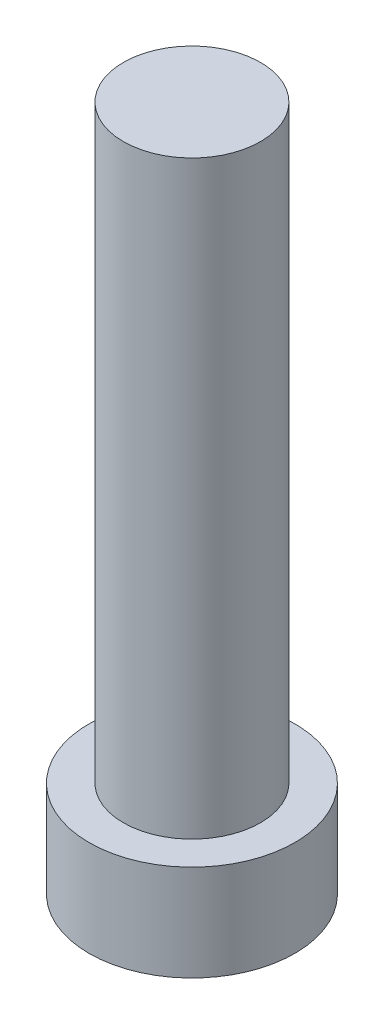
ISO-10303-21;
HEADER;
FILE_DESCRIPTION(('STEP AP214'),'2;1');
FILE_NAME('part.step','',(''),(''),'','','');
FILE_SCHEMA(('AUTOMOTIVE_DESIGN { 1 0 10303 214 1 1 1 1 }'));
ENDSEC;
DATA;
#1=APPLICATION_CONTEXT('core data for automotive mechanical design processes');
#2=APPLICATION_PROTOCOL_DEFINITION('international standard','automotive_design',2000,#1);
#3=PRODUCT_CONTEXT('',#1,'mechanical');
#4=PRODUCT('Part','Part','',(#3));
#5=PRODUCT_RELATED_PRODUCT_CATEGORY('part','',(#4));
#6=PRODUCT_DEFINITION_FORMATION('','',#4);
#7=PRODUCT_DEFINITION_CONTEXT('part definition',#1,'design');
#8=PRODUCT_DEFINITION('design','',#6,#7);
#9=PRODUCT_DEFINITION_SHAPE('','',#8);
#10=(LENGTH_UNIT() NAMED_UNIT(*) SI_UNIT(.MILLI.,.METRE.));
#11=(NAMED_UNIT(*) PLANE_ANGLE_UNIT() SI_UNIT($,.RADIAN.));
#12=(NAMED_UNIT(*) SI_UNIT($,.STERADIAN.) SOLID_ANGLE_UNIT());
#13=UNCERTAINTY_MEASURE_WITH_UNIT(LENGTH_MEASURE(1.E-05),#10,'distance_accuracy_value','');
#14=(GEOMETRIC_REPRESENTATION_CONTEXT(3) GLOBAL_UNCERTAINTY_ASSIGNED_CONTEXT((#13)) GLOBAL_UNIT_ASSIGNED_CONTEXT((#10,
#11,#12)) REPRESENTATION_CONTEXT('',''));
#15=CARTESIAN_POINT('',(0.,0.,0.));
#16=DIRECTION('',(0.,0.,1.));
#17=DIRECTION('',(1.,0.,0.));
#18=AXIS2_PLACEMENT_3D('',#15,#16,#17);
#19=CARTESIAN_POINT('',(0.,7.,0.));
#20=DIRECTION('',(0.,-1.,0.));
#21=DIRECTION('',(0.,0.,-1.));
#22=AXIS2_PLACEMENT_3D('',#19,#20,#21);
#23=CYLINDRICAL_SURFACE('',#22,7.5);
#24=CARTESIAN_POINT('',(0.,7.,0.));
#25=DIRECTION('',(0.,1.,0.));
#26=DIRECTION('',(0.,0.,1.));
#27=AXIS2_PLACEMENT_3D('',#24,#25,#26);
#28=CIRCLE('',#27,7.5);
#29=CARTESIAN_POINT('',(0.,7.,7.5));
#30=VERTEX_POINT('',#29);
#31=EDGE_CURVE('E45',#30,#30,#28,.T.);
#32=ORIENTED_EDGE('',*,*,#31,.F.);
#33=EDGE_LOOP('',(#32));
#34=FACE_BOUND('',#33,.T.);
#35=CARTESIAN_POINT('',(0.,0.,0.));
#36=DIRECTION('',(0.,1.,0.));
#37=DIRECTION('',(0.,0.,1.));
#38=AXIS2_PLACEMENT_3D('',#35,#36,#37);
#39=CIRCLE('',#38,7.5);
#40=CARTESIAN_POINT('',(0.,0.,7.5));
#41=VERTEX_POINT('',#40);
#42=EDGE_CURVE('E40',#41,#41,#39,.T.);
#43=ORIENTED_EDGE('',*,*,#42,.T.);
#44=EDGE_LOOP('',(#43));
#45=FACE_BOUND('',#44,.T.);
#46=ADVANCED_FACE('F37',(#34,#45),#23,.T.);
#47=CARTESIAN_POINT('',(0.,7.,0.));
#48=DIRECTION('',(0.,1.,0.));
#49=DIRECTION('',(0.,0.,1.));
#50=AXIS2_PLACEMENT_3D('',#47,#48,#49);
#51=PLANE('',#50);
#52=CARTESIAN_POINT('',(0.,7.,0.));
#53=DIRECTION('',(0.,1.,0.));
#54=DIRECTION('',(0.,0.,1.));
#55=AXIS2_PLACEMENT_3D('',#52,#53,#54);
#56=CIRCLE('',#55,5.);
#57=CARTESIAN_POINT('',(0.,7.,5.));
#58=VERTEX_POINT('',#57);
#59=EDGE_CURVE('E10',#58,#58,#56,.T.);
#60=ORIENTED_EDGE('',*,*,#59,.F.);
#61=EDGE_LOOP('',(#60));
#62=FACE_BOUND('',#61,.T.);
#63=ORIENTED_EDGE('',*,*,#31,.T.);
#64=EDGE_LOOP('',(#63));
#65=FACE_BOUND('',#64,.T.);
#66=ADVANCED_FACE('F65',(#62,#65),#51,.T.);
#67=CARTESIAN_POINT('',(0.,0.,0.));
#68=DIRECTION('',(0.,1.,0.));
#69=DIRECTION('',(0.,0.,1.));
#70=AXIS2_PLACEMENT_3D('',#67,#68,#69);
#71=PLANE('',#70);
#72=ORIENTED_EDGE('',*,*,#42,.F.);
#73=EDGE_LOOP('',(#72));
#74=FACE_BOUND('',#73,.T.);
#75=ADVANCED_FACE('F62',(#74),#71,.F.);
#76=CARTESIAN_POINT('',(0.,50.,0.));
#77=DIRECTION('',(0.,-1.,0.));
#78=DIRECTION('',(0.,0.,-1.));
#79=AXIS2_PLACEMENT_3D('',#76,#77,#78);
#80=CYLINDRICAL_SURFACE('',#79,5.);
#81=CARTESIAN_POINT('',(0.,50.,0.));
#82=DIRECTION('',(0.,1.,0.));
#83=DIRECTION('',(0.,0.,1.));
#84=AXIS2_PLACEMENT_3D('',#81,#82,#83);
#85=CIRCLE('',#84,5.);
#86=CARTESIAN_POINT('',(0.,50.,5.));
#87=VERTEX_POINT('',#86);
#88=EDGE_CURVE('E52',#87,#87,#85,.T.);
#89=ORIENTED_EDGE('',*,*,#88,.F.);
#90=EDGE_LOOP('',(#89));
#91=FACE_BOUND('',#90,.T.);
#92=ORIENTED_EDGE('',*,*,#59,.T.);
#93=EDGE_LOOP('',(#92));
#94=FACE_BOUND('',#93,.T.);
#95=ADVANCED_FACE('F64',(#91,#94),#80,.T.);
#96=CARTESIAN_POINT('',(0.,50.,0.));
#97=DIRECTION('',(0.,1.,0.));
#98=DIRECTION('',(0.,0.,1.));
#99=AXIS2_PLACEMENT_3D('',#96,#97,#98);
#100=PLANE('',#99);
#101=ORIENTED_EDGE('',*,*,#88,.T.);
#102=EDGE_LOOP('',(#101));
#103=FACE_BOUND('',#102,.T.);
#104=ADVANCED_FACE('F70',(#103),#100,.T.);
#105=CLOSED_SHELL('',(#46,#66,#75,#95,#104));
#106=MANIFOLD_SOLID_BREP('B2',#105);
#107=ADVANCED_BREP_SHAPE_REPRESENTATION('',(#18,#106),#14);
#108=SHAPE_DEFINITION_REPRESENTATION(#9,#107);
ENDSEC;
END-ISO-10303-21;
